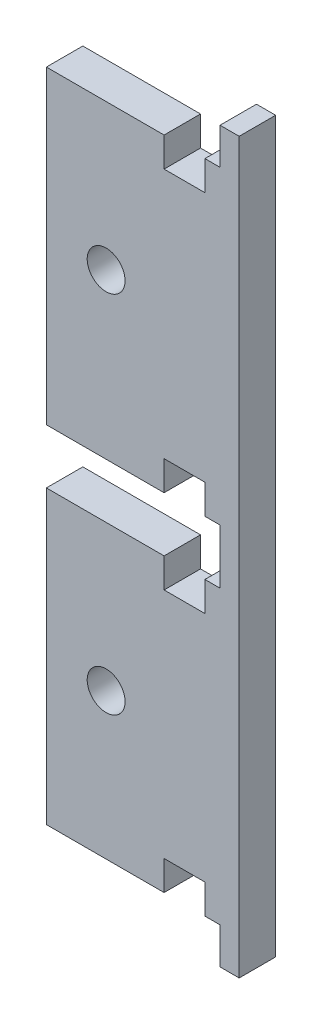
ISO-10303-21;
HEADER;
FILE_DESCRIPTION(('STEP AP214'),'2;1');
FILE_NAME('part.step','',(''),(''),'','','');
FILE_SCHEMA(('AUTOMOTIVE_DESIGN { 1 0 10303 214 1 1 1 1 }'));
ENDSEC;
DATA;
#1=APPLICATION_CONTEXT('core data for automotive mechanical design processes');
#2=APPLICATION_PROTOCOL_DEFINITION('international standard','automotive_design',2000,#1);
#3=PRODUCT_CONTEXT('',#1,'mechanical');
#4=PRODUCT('Part','Part','',(#3));
#5=PRODUCT_RELATED_PRODUCT_CATEGORY('part','',(#4));
#6=PRODUCT_DEFINITION_FORMATION('','',#4);
#7=PRODUCT_DEFINITION_CONTEXT('part definition',#1,'design');
#8=PRODUCT_DEFINITION('design','',#6,#7);
#9=PRODUCT_DEFINITION_SHAPE('','',#8);
#10=(LENGTH_UNIT() NAMED_UNIT(*) SI_UNIT(.MILLI.,.METRE.));
#11=(NAMED_UNIT(*) PLANE_ANGLE_UNIT() SI_UNIT($,.RADIAN.));
#12=(NAMED_UNIT(*) SI_UNIT($,.STERADIAN.) SOLID_ANGLE_UNIT());
#13=UNCERTAINTY_MEASURE_WITH_UNIT(LENGTH_MEASURE(1.E-05),#10,'distance_accuracy_value','');
#14=(GEOMETRIC_REPRESENTATION_CONTEXT(3) GLOBAL_UNCERTAINTY_ASSIGNED_CONTEXT((#13)) GLOBAL_UNIT_ASSIGNED_CONTEXT((#10,
#11,#12)) REPRESENTATION_CONTEXT('',''));
#15=CARTESIAN_POINT('',(0.,0.,0.));
#16=DIRECTION('',(0.,0.,1.));
#17=DIRECTION('',(1.,0.,0.));
#18=AXIS2_PLACEMENT_3D('',#15,#16,#17);
#19=CARTESIAN_POINT('',(0.,0.,0.));
#20=DIRECTION('',(0.,0.,-1.));
#21=DIRECTION('',(-1.,0.,0.));
#22=AXIS2_PLACEMENT_3D('',#19,#20,#21);
#23=PLANE('',#22);
#24=DIRECTION('',(0.,-1.,0.));
#25=VECTOR('',#24,1.);
#26=CARTESIAN_POINT('',(27.559,0.,0.));
#27=LINE('',#26,#25);
#28=CARTESIAN_POINT('',(27.559,11.4935,0.));
#29=VERTEX_POINT('',#28);
#30=CARTESIAN_POINT('',(27.559,6.34999999999999,0.));
#31=VERTEX_POINT('',#30);
#32=EDGE_CURVE('E225',#29,#31,#27,.T.);
#33=ORIENTED_EDGE('',*,*,#32,.T.);
#34=DIRECTION('',(-1.,0.,0.));
#35=VECTOR('',#34,1.);
#36=CARTESIAN_POINT('',(0.,6.34999999999999,0.));
#37=LINE('',#36,#35);
#38=CARTESIAN_POINT('',(7.05049999999835,6.34999999999999,0.));
#39=VERTEX_POINT('',#38);
#40=EDGE_CURVE('E365',#31,#39,#37,.T.);
#41=ORIENTED_EDGE('',*,*,#40,.T.);
#42=DIRECTION('',(0.,-1.,0.));
#43=VECTOR('',#42,1.);
#44=CARTESIAN_POINT('',(7.05049999999835,0.,0.));
#45=LINE('',#44,#43);
#46=CARTESIAN_POINT('',(7.05049999999834,57.1500000000057,0.));
#47=VERTEX_POINT('',#46);
#48=EDGE_CURVE('E326',#47,#39,#45,.T.);
#49=ORIENTED_EDGE('',*,*,#48,.F.);
#50=DIRECTION('',(1.,0.,0.));
#51=VECTOR('',#50,1.);
#52=CARTESIAN_POINT('',(0.,57.1500000000057,0.));
#53=LINE('',#52,#51);
#54=CARTESIAN_POINT('',(27.5589999999997,57.1500000000057,0.));
#55=VERTEX_POINT('',#54);
#56=EDGE_CURVE('E331',#47,#55,#53,.T.);
#57=ORIENTED_EDGE('',*,*,#56,.T.);
#58=DIRECTION('',(0.,-1.,0.));
#59=VECTOR('',#58,1.);
#60=CARTESIAN_POINT('',(27.5589999999997,0.,0.));
#61=LINE('',#60,#59);
#62=CARTESIAN_POINT('',(27.5589999999997,52.0065000000031,0.));
#63=VERTEX_POINT('',#62);
#64=EDGE_CURVE('E250',#55,#63,#61,.T.);
#65=ORIENTED_EDGE('',*,*,#64,.T.);
#66=DIRECTION('',(-1.,0.,0.));
#67=VECTOR('',#66,1.);
#68=CARTESIAN_POINT('',(0.,52.0065000000031,0.));
#69=LINE('',#68,#67);
#70=CARTESIAN_POINT('',(34.6709999999997,52.0065000000031,0.));
#71=VERTEX_POINT('',#70);
#72=EDGE_CURVE('E253',#71,#63,#69,.T.);
#73=ORIENTED_EDGE('',*,*,#72,.F.);
#74=DIRECTION('',(0.,-1.,0.));
#75=VECTOR('',#74,1.);
#76=CARTESIAN_POINT('',(34.6709999999997,0.,0.));
#77=LINE('',#76,#75);
#78=CARTESIAN_POINT('',(34.6709999999997,57.1500000000057,0.));
#79=VERTEX_POINT('',#78);
#80=EDGE_CURVE('E256',#79,#71,#77,.T.);
#81=ORIENTED_EDGE('',*,*,#80,.F.);
#82=CARTESIAN_POINT('',(37.3062500000001,57.1500000000057,0.));
#83=VERTEX_POINT('',#82);
#84=EDGE_CURVE('E335',#79,#83,#53,.T.);
#85=ORIENTED_EDGE('',*,*,#84,.T.);
#86=DIRECTION('',(0.,-1.,0.));
#87=VECTOR('',#86,1.);
#88=CARTESIAN_POINT('',(37.3062500000001,0.,0.));
#89=LINE('',#88,#87);
#90=CARTESIAN_POINT('',(37.3062500000001,66.6750000000059,0.));
#91=VERTEX_POINT('',#90);
#92=EDGE_CURVE('E334',#91,#83,#89,.T.);
#93=ORIENTED_EDGE('',*,*,#92,.F.);
#94=DIRECTION('',(-1.,0.,0.));
#95=VECTOR('',#94,1.);
#96=CARTESIAN_POINT('',(0.,66.6750000000059,0.));
#97=LINE('',#96,#95);
#98=CARTESIAN_POINT('',(34.6709999999998,66.6750000000059,0.));
#99=VERTEX_POINT('',#98);
#100=EDGE_CURVE('E339',#91,#99,#97,.T.);
#101=ORIENTED_EDGE('',*,*,#100,.T.);
#102=DIRECTION('',(0.,-1.,0.));
#103=VECTOR('',#102,1.);
#104=CARTESIAN_POINT('',(34.6709999999998,0.,0.));
#105=LINE('',#104,#103);
#106=CARTESIAN_POINT('',(34.6709999999998,71.8185000000033,0.));
#107=VERTEX_POINT('',#106);
#108=EDGE_CURVE('E270',#107,#99,#105,.T.);
#109=ORIENTED_EDGE('',*,*,#108,.F.);
#110=DIRECTION('',(-1.,0.,0.));
#111=VECTOR('',#110,1.);
#112=CARTESIAN_POINT('',(0.,71.8185000000033,0.));
#113=LINE('',#112,#111);
#114=CARTESIAN_POINT('',(27.5589999999998,71.8185000000033,0.));
#115=VERTEX_POINT('',#114);
#116=EDGE_CURVE('E272',#107,#115,#113,.T.);
#117=ORIENTED_EDGE('',*,*,#116,.T.);
#118=DIRECTION('',(0.,-1.,0.));
#119=VECTOR('',#118,1.);
#120=CARTESIAN_POINT('',(27.5589999999998,0.,0.));
#121=LINE('',#120,#119);
#122=CARTESIAN_POINT('',(27.5589999999998,66.6750000000059,0.));
#123=VERTEX_POINT('',#122);
#124=EDGE_CURVE('E275',#115,#123,#121,.T.);
#125=ORIENTED_EDGE('',*,*,#124,.T.);
#126=CARTESIAN_POINT('',(7.05049999999834,66.6750000000059,0.));
#127=VERTEX_POINT('',#126);
#128=EDGE_CURVE('E338',#123,#127,#97,.T.);
#129=ORIENTED_EDGE('',*,*,#128,.T.);
#130=CARTESIAN_POINT('',(7.05049999999834,120.650000000002,0.));
#131=VERTEX_POINT('',#130);
#132=EDGE_CURVE('E382',#131,#127,#45,.T.);
#133=ORIENTED_EDGE('',*,*,#132,.F.);
#134=DIRECTION('',(1.,0.,0.));
#135=VECTOR('',#134,1.);
#136=CARTESIAN_POINT('',(0.,120.650000000002,0.));
#137=LINE('',#136,#135);
#138=CARTESIAN_POINT('',(27.5589999999998,120.650000000002,0.));
#139=VERTEX_POINT('',#138);
#140=EDGE_CURVE('E308',#131,#139,#137,.T.);
#141=ORIENTED_EDGE('',*,*,#140,.T.);
#142=DIRECTION('',(0.,-1.,0.));
#143=VECTOR('',#142,1.);
#144=CARTESIAN_POINT('',(27.5589999999998,0.,0.));
#145=LINE('',#144,#143);
#146=CARTESIAN_POINT('',(27.5589999999998,115.5065,0.));
#147=VERTEX_POINT('',#146);
#148=EDGE_CURVE('E289',#139,#147,#145,.T.);
#149=ORIENTED_EDGE('',*,*,#148,.T.);
#150=DIRECTION('',(-1.,0.,0.));
#151=VECTOR('',#150,1.);
#152=CARTESIAN_POINT('',(0.,115.5065,0.));
#153=LINE('',#152,#151);
#154=CARTESIAN_POINT('',(34.6709999999998,115.5065,0.));
#155=VERTEX_POINT('',#154);
#156=EDGE_CURVE('E292',#155,#147,#153,.T.);
#157=ORIENTED_EDGE('',*,*,#156,.F.);
#158=DIRECTION('',(0.,-1.,0.));
#159=VECTOR('',#158,1.);
#160=CARTESIAN_POINT('',(34.6709999999998,0.,0.));
#161=LINE('',#160,#159);
#162=CARTESIAN_POINT('',(34.6709999999998,120.650000000002,0.));
#163=VERTEX_POINT('',#162);
#164=EDGE_CURVE('E295',#163,#155,#161,.T.);
#165=ORIENTED_EDGE('',*,*,#164,.F.);
#166=CARTESIAN_POINT('',(37.3062500000001,120.650000000002,0.));
#167=VERTEX_POINT('',#166);
#168=EDGE_CURVE('E312',#163,#167,#137,.T.);
#169=ORIENTED_EDGE('',*,*,#168,.T.);
#170=DIRECTION('',(0.,-1.,0.));
#171=VECTOR('',#170,1.);
#172=CARTESIAN_POINT('',(37.3062500000001,0.,0.));
#173=LINE('',#172,#171);
#174=CARTESIAN_POINT('',(37.30625,127.,0.));
#175=VERTEX_POINT('',#174);
#176=EDGE_CURVE('E311',#175,#167,#173,.T.);
#177=ORIENTED_EDGE('',*,*,#176,.F.);
#178=DIRECTION('',(-1.,0.,0.));
#179=VECTOR('',#178,1.);
#180=CARTESIAN_POINT('',(0.,127.,0.));
#181=LINE('',#180,#179);
#182=CARTESIAN_POINT('',(40.64,127.,0.));
#183=VERTEX_POINT('',#182);
#184=EDGE_CURVE('E403',#183,#175,#181,.T.);
#185=ORIENTED_EDGE('',*,*,#184,.F.);
#186=DIRECTION('',(0.,1.,0.));
#187=VECTOR('',#186,1.);
#188=CARTESIAN_POINT('',(40.64,0.,0.));
#189=LINE('',#188,#187);
#190=CARTESIAN_POINT('',(40.64,0.,0.));
#191=VERTEX_POINT('',#190);
#192=EDGE_CURVE('E410',#191,#183,#189,.T.);
#193=ORIENTED_EDGE('',*,*,#192,.F.);
#194=DIRECTION('',(1.,0.,0.));
#195=VECTOR('',#194,1.);
#196=CARTESIAN_POINT('',(0.,0.,0.));
#197=LINE('',#196,#195);
#198=CARTESIAN_POINT('',(37.3062500000001,0.,0.));
#199=VERTEX_POINT('',#198);
#200=EDGE_CURVE('E399',#199,#191,#197,.T.);
#201=ORIENTED_EDGE('',*,*,#200,.F.);
#202=DIRECTION('',(0.,-1.,0.));
#203=VECTOR('',#202,1.);
#204=CARTESIAN_POINT('',(37.3062500000001,0.,0.));
#205=LINE('',#204,#203);
#206=CARTESIAN_POINT('',(37.3062500000001,6.34999999999999,0.));
#207=VERTEX_POINT('',#206);
#208=EDGE_CURVE('E363',#207,#199,#205,.T.);
#209=ORIENTED_EDGE('',*,*,#208,.F.);
#210=CARTESIAN_POINT('',(34.671,6.34999999999999,0.));
#211=VERTEX_POINT('',#210);
#212=EDGE_CURVE('E238',#207,#211,#37,.T.);
#213=ORIENTED_EDGE('',*,*,#212,.T.);
#214=DIRECTION('',(0.,-1.,0.));
#215=VECTOR('',#214,1.);
#216=CARTESIAN_POINT('',(34.671,0.,0.));
#217=LINE('',#216,#215);
#218=CARTESIAN_POINT('',(34.671,11.4935,0.));
#219=VERTEX_POINT('',#218);
#220=EDGE_CURVE('E48',#219,#211,#217,.T.);
#221=ORIENTED_EDGE('',*,*,#220,.F.);
#222=DIRECTION('',(-1.,0.,0.));
#223=VECTOR('',#222,1.);
#224=CARTESIAN_POINT('',(0.,11.4935,0.));
#225=LINE('',#224,#223);
#226=EDGE_CURVE('E228',#219,#29,#225,.T.);
#227=ORIENTED_EDGE('',*,*,#226,.T.);
#228=EDGE_LOOP('',(#33,#41,#49,#57,#65,#73,#81,#85,#93,#101,#109,#117,#125,#129,#133,#141,#149,
#157,#165,#169,#177,#185,#193,#201,#209,#213,#221,#227));
#229=FACE_BOUND('',#228,.T.);
#230=CARTESIAN_POINT('',(17.4625000000007,31.7500000000036,0.));
#231=DIRECTION('',(0.,0.,1.));
#232=DIRECTION('',(1.,0.,0.));
#233=AXIS2_PLACEMENT_3D('',#230,#231,#232);
#234=CIRCLE('',#233,3.3);
#235=CARTESIAN_POINT('',(20.7625000000007,31.7500000000036,0.));
#236=VERTEX_POINT('',#235);
#237=EDGE_CURVE('E390',#236,#236,#234,.T.);
#238=ORIENTED_EDGE('',*,*,#237,.T.);
#239=EDGE_LOOP('',(#238));
#240=FACE_BOUND('',#239,.T.);
#241=CARTESIAN_POINT('',(17.4624999999983,95.25,0.));
#242=DIRECTION('',(0.,0.,1.));
#243=DIRECTION('',(1.,0.,0.));
#244=AXIS2_PLACEMENT_3D('',#241,#242,#243);
#245=CIRCLE('',#244,3.3);
#246=CARTESIAN_POINT('',(20.7624999999983,95.25,0.));
#247=VERTEX_POINT('',#246);
#248=EDGE_CURVE('E396',#247,#247,#245,.T.);
#249=ORIENTED_EDGE('',*,*,#248,.T.);
#250=EDGE_LOOP('',(#249));
#251=FACE_BOUND('',#250,.T.);
#252=ADVANCED_FACE('F33',(#229,#240,#251),#23,.T.);
#253=CARTESIAN_POINT('',(0.,0.,6.35));
#254=DIRECTION('',(0.,0.,-1.));
#255=DIRECTION('',(-1.,0.,0.));
#256=AXIS2_PLACEMENT_3D('',#253,#254,#255);
#257=PLANE('',#256);
#258=CARTESIAN_POINT('',(17.4624999999983,95.25,6.35));
#259=DIRECTION('',(0.,0.,1.));
#260=DIRECTION('',(1.,0.,0.));
#261=AXIS2_PLACEMENT_3D('',#258,#259,#260);
#262=CIRCLE('',#261,3.29999999999999);
#263=CARTESIAN_POINT('',(20.7624999999983,95.25,6.35));
#264=VERTEX_POINT('',#263);
#265=EDGE_CURVE('E393',#264,#264,#262,.T.);
#266=ORIENTED_EDGE('',*,*,#265,.F.);
#267=EDGE_LOOP('',(#266));
#268=FACE_BOUND('',#267,.T.);
#269=CARTESIAN_POINT('',(17.4625000000007,31.7500000000036,6.35));
#270=DIRECTION('',(0.,0.,1.));
#271=DIRECTION('',(1.,0.,0.));
#272=AXIS2_PLACEMENT_3D('',#269,#270,#271);
#273=CIRCLE('',#272,3.29999999999999);
#274=CARTESIAN_POINT('',(20.7625000000006,31.7500000000036,6.35));
#275=VERTEX_POINT('',#274);
#276=EDGE_CURVE('E387',#275,#275,#273,.T.);
#277=ORIENTED_EDGE('',*,*,#276,.F.);
#278=EDGE_LOOP('',(#277));
#279=FACE_BOUND('',#278,.T.);
#280=DIRECTION('',(-1.,0.,0.));
#281=VECTOR('',#280,1.);
#282=CARTESIAN_POINT('',(0.,6.34999999999999,6.35));
#283=LINE('',#282,#281);
#284=CARTESIAN_POINT('',(27.559,6.34999999999999,6.35));
#285=VERTEX_POINT('',#284);
#286=CARTESIAN_POINT('',(7.05049999999835,6.34999999999999,6.35));
#287=VERTEX_POINT('',#286);
#288=EDGE_CURVE('E371',#285,#287,#283,.T.);
#289=ORIENTED_EDGE('',*,*,#288,.F.);
#290=DIRECTION('',(0.,-1.,0.));
#291=VECTOR('',#290,1.);
#292=CARTESIAN_POINT('',(27.559,0.,6.35));
#293=LINE('',#292,#291);
#294=CARTESIAN_POINT('',(27.559,11.4935,6.35));
#295=VERTEX_POINT('',#294);
#296=EDGE_CURVE('E239',#295,#285,#293,.T.);
#297=ORIENTED_EDGE('',*,*,#296,.F.);
#298=DIRECTION('',(-1.,0.,0.));
#299=VECTOR('',#298,1.);
#300=CARTESIAN_POINT('',(0.,11.4935,6.35));
#301=LINE('',#300,#299);
#302=CARTESIAN_POINT('',(34.671,11.4935,6.35));
#303=VERTEX_POINT('',#302);
#304=EDGE_CURVE('E241',#303,#295,#301,.T.);
#305=ORIENTED_EDGE('',*,*,#304,.F.);
#306=DIRECTION('',(0.,-1.,0.));
#307=VECTOR('',#306,1.);
#308=CARTESIAN_POINT('',(34.671,0.,6.35));
#309=LINE('',#308,#307);
#310=CARTESIAN_POINT('',(34.671,6.34999999999999,6.35));
#311=VERTEX_POINT('',#310);
#312=EDGE_CURVE('E220',#303,#311,#309,.T.);
#313=ORIENTED_EDGE('',*,*,#312,.T.);
#314=CARTESIAN_POINT('',(37.3062500000001,6.34999999999999,6.35));
#315=VERTEX_POINT('',#314);
#316=EDGE_CURVE('E366',#315,#311,#283,.T.);
#317=ORIENTED_EDGE('',*,*,#316,.F.);
#318=DIRECTION('',(0.,-1.,0.));
#319=VECTOR('',#318,1.);
#320=CARTESIAN_POINT('',(37.3062500000001,0.,6.35));
#321=LINE('',#320,#319);
#322=CARTESIAN_POINT('',(37.3062500000001,0.,6.35));
#323=VERTEX_POINT('',#322);
#324=EDGE_CURVE('E248',#315,#323,#321,.T.);
#325=ORIENTED_EDGE('',*,*,#324,.T.);
#326=DIRECTION('',(1.,0.,0.));
#327=VECTOR('',#326,1.);
#328=CARTESIAN_POINT('',(0.,0.,6.35));
#329=LINE('',#328,#327);
#330=CARTESIAN_POINT('',(40.64,0.,6.35));
#331=VERTEX_POINT('',#330);
#332=EDGE_CURVE('E400',#323,#331,#329,.T.);
#333=ORIENTED_EDGE('',*,*,#332,.T.);
#334=DIRECTION('',(0.,1.,0.));
#335=VECTOR('',#334,1.);
#336=CARTESIAN_POINT('',(40.64,0.,6.35));
#337=LINE('',#336,#335);
#338=CARTESIAN_POINT('',(40.64,127.,6.35));
#339=VERTEX_POINT('',#338);
#340=EDGE_CURVE('E402',#331,#339,#337,.T.);
#341=ORIENTED_EDGE('',*,*,#340,.T.);
#342=DIRECTION('',(-1.,0.,0.));
#343=VECTOR('',#342,1.);
#344=CARTESIAN_POINT('',(0.,127.,6.35));
#345=LINE('',#344,#343);
#346=CARTESIAN_POINT('',(37.30625,127.,6.35));
#347=VERTEX_POINT('',#346);
#348=EDGE_CURVE('E405',#339,#347,#345,.T.);
#349=ORIENTED_EDGE('',*,*,#348,.T.);
#350=DIRECTION('',(0.,-1.,0.));
#351=VECTOR('',#350,1.);
#352=CARTESIAN_POINT('',(37.3062500000001,0.,6.35));
#353=LINE('',#352,#351);
#354=CARTESIAN_POINT('',(37.3062500000001,120.650000000002,6.35));
#355=VERTEX_POINT('',#354);
#356=EDGE_CURVE('E319',#347,#355,#353,.T.);
#357=ORIENTED_EDGE('',*,*,#356,.T.);
#358=DIRECTION('',(1.,0.,0.));
#359=VECTOR('',#358,1.);
#360=CARTESIAN_POINT('',(0.,120.650000000002,6.35));
#361=LINE('',#360,#359);
#362=CARTESIAN_POINT('',(34.6709999999998,120.650000000002,6.35));
#363=VERTEX_POINT('',#362);
#364=EDGE_CURVE('E320',#363,#355,#361,.T.);
#365=ORIENTED_EDGE('',*,*,#364,.F.);
#366=DIRECTION('',(0.,-1.,0.));
#367=VECTOR('',#366,1.);
#368=CARTESIAN_POINT('',(34.6709999999998,0.,6.35));
#369=LINE('',#368,#367);
#370=CARTESIAN_POINT('',(34.6709999999998,115.5065,6.35));
#371=VERTEX_POINT('',#370);
#372=EDGE_CURVE('E293',#363,#371,#369,.T.);
#373=ORIENTED_EDGE('',*,*,#372,.T.);
#374=DIRECTION('',(-1.,0.,0.));
#375=VECTOR('',#374,1.);
#376=CARTESIAN_POINT('',(0.,115.5065,6.35));
#377=LINE('',#376,#375);
#378=CARTESIAN_POINT('',(27.5589999999998,115.5065,6.35));
#379=VERTEX_POINT('',#378);
#380=EDGE_CURVE('E300',#371,#379,#377,.T.);
#381=ORIENTED_EDGE('',*,*,#380,.T.);
#382=DIRECTION('',(0.,-1.,0.));
#383=VECTOR('',#382,1.);
#384=CARTESIAN_POINT('',(27.5589999999998,0.,6.35));
#385=LINE('',#384,#383);
#386=CARTESIAN_POINT('',(27.5589999999998,120.650000000002,6.35));
#387=VERTEX_POINT('',#386);
#388=EDGE_CURVE('E298',#387,#379,#385,.T.);
#389=ORIENTED_EDGE('',*,*,#388,.F.);
#390=CARTESIAN_POINT('',(7.05049999999834,120.650000000002,6.35));
#391=VERTEX_POINT('',#390);
#392=EDGE_CURVE('E316',#391,#387,#361,.T.);
#393=ORIENTED_EDGE('',*,*,#392,.F.);
#394=DIRECTION('',(0.,1.,0.));
#395=VECTOR('',#394,1.);
#396=CARTESIAN_POINT('',(7.05049999999835,0.,6.35));
#397=LINE('',#396,#395);
#398=CARTESIAN_POINT('',(7.05049999999834,66.6750000000059,6.35));
#399=VERTEX_POINT('',#398);
#400=EDGE_CURVE('E383',#399,#391,#397,.T.);
#401=ORIENTED_EDGE('',*,*,#400,.F.);
#402=DIRECTION('',(-1.,0.,0.));
#403=VECTOR('',#402,1.);
#404=CARTESIAN_POINT('',(0.,66.6750000000059,6.35));
#405=LINE('',#404,#403);
#406=CARTESIAN_POINT('',(27.5589999999998,66.6750000000059,6.35));
#407=VERTEX_POINT('',#406);
#408=EDGE_CURVE('E350',#407,#399,#405,.T.);
#409=ORIENTED_EDGE('',*,*,#408,.F.);
#410=DIRECTION('',(0.,-1.,0.));
#411=VECTOR('',#410,1.);
#412=CARTESIAN_POINT('',(27.5589999999998,0.,6.35));
#413=LINE('',#412,#411);
#414=CARTESIAN_POINT('',(27.5589999999998,71.8185000000033,6.35));
#415=VERTEX_POINT('',#414);
#416=EDGE_CURVE('E56',#415,#407,#413,.T.);
#417=ORIENTED_EDGE('',*,*,#416,.F.);
#418=DIRECTION('',(-1.,0.,0.));
#419=VECTOR('',#418,1.);
#420=CARTESIAN_POINT('',(0.,71.8185000000033,6.35));
#421=LINE('',#420,#419);
#422=CARTESIAN_POINT('',(34.6709999999998,71.8185000000033,6.35));
#423=VERTEX_POINT('',#422);
#424=EDGE_CURVE('E282',#423,#415,#421,.T.);
#425=ORIENTED_EDGE('',*,*,#424,.F.);
#426=DIRECTION('',(0.,-1.,0.));
#427=VECTOR('',#426,1.);
#428=CARTESIAN_POINT('',(34.6709999999998,0.,6.35));
#429=LINE('',#428,#427);
#430=CARTESIAN_POINT('',(34.6709999999998,66.6750000000059,6.35));
#431=VERTEX_POINT('',#430);
#432=EDGE_CURVE('E279',#423,#431,#429,.T.);
#433=ORIENTED_EDGE('',*,*,#432,.T.);
#434=CARTESIAN_POINT('',(37.3062500000001,66.6750000000059,6.35));
#435=VERTEX_POINT('',#434);
#436=EDGE_CURVE('E351',#435,#431,#405,.T.);
#437=ORIENTED_EDGE('',*,*,#436,.F.);
#438=DIRECTION('',(0.,-1.,0.));
#439=VECTOR('',#438,1.);
#440=CARTESIAN_POINT('',(37.3062500000001,0.,6.35));
#441=LINE('',#440,#439);
#442=CARTESIAN_POINT('',(37.3062500000001,57.1500000000057,6.35));
#443=VERTEX_POINT('',#442);
#444=EDGE_CURVE('E346',#435,#443,#441,.T.);
#445=ORIENTED_EDGE('',*,*,#444,.T.);
#446=DIRECTION('',(1.,0.,0.));
#447=VECTOR('',#446,1.);
#448=CARTESIAN_POINT('',(0.,57.1500000000057,6.35));
#449=LINE('',#448,#447);
#450=CARTESIAN_POINT('',(34.6709999999997,57.1500000000057,6.35));
#451=VERTEX_POINT('',#450);
#452=EDGE_CURVE('E347',#451,#443,#449,.T.);
#453=ORIENTED_EDGE('',*,*,#452,.F.);
#454=DIRECTION('',(0.,-1.,0.));
#455=VECTOR('',#454,1.);
#456=CARTESIAN_POINT('',(34.6709999999997,0.,6.35));
#457=LINE('',#456,#455);
#458=CARTESIAN_POINT('',(34.6709999999997,52.0065000000031,6.35));
#459=VERTEX_POINT('',#458);
#460=EDGE_CURVE('E254',#451,#459,#457,.T.);
#461=ORIENTED_EDGE('',*,*,#460,.T.);
#462=DIRECTION('',(-1.,0.,0.));
#463=VECTOR('',#462,1.);
#464=CARTESIAN_POINT('',(0.,52.0065000000031,6.35));
#465=LINE('',#464,#463);
#466=CARTESIAN_POINT('',(27.5589999999997,52.0065000000031,6.35));
#467=VERTEX_POINT('',#466);
#468=EDGE_CURVE('E261',#459,#467,#465,.T.);
#469=ORIENTED_EDGE('',*,*,#468,.T.);
#470=DIRECTION('',(0.,-1.,0.));
#471=VECTOR('',#470,1.);
#472=CARTESIAN_POINT('',(27.5589999999997,0.,6.35));
#473=LINE('',#472,#471);
#474=CARTESIAN_POINT('',(27.5589999999997,57.1500000000057,6.35));
#475=VERTEX_POINT('',#474);
#476=EDGE_CURVE('E259',#475,#467,#473,.T.);
#477=ORIENTED_EDGE('',*,*,#476,.F.);
#478=CARTESIAN_POINT('',(7.05049999999834,57.1500000000057,6.35));
#479=VERTEX_POINT('',#478);
#480=EDGE_CURVE('E343',#479,#475,#449,.T.);
#481=ORIENTED_EDGE('',*,*,#480,.F.);
#482=EDGE_CURVE('E386',#287,#479,#397,.T.);
#483=ORIENTED_EDGE('',*,*,#482,.F.);
#484=EDGE_LOOP('',(#289,#297,#305,#313,#317,#325,#333,#341,#349,#357,#365,#373,#381,#389,#393,
#401,#409,#417,#425,#433,#437,#445,#453,#461,#469,#477,#481,#483));
#485=FACE_BOUND('',#484,.T.);
#486=ADVANCED_FACE('F436',(#268,#279,#485),#257,.F.);
#487=CARTESIAN_POINT('',(0.,6.34999999999999,0.));
#488=DIRECTION('',(0.,1.,0.));
#489=DIRECTION('',(-1.,0.,0.));
#490=AXIS2_PLACEMENT_3D('',#487,#488,#489);
#491=PLANE('',#490);
#492=DIRECTION('',(0.,0.,1.));
#493=VECTOR('',#492,1.);
#494=CARTESIAN_POINT('',(34.671,6.34999999999999,0.));
#495=LINE('',#494,#493);
#496=EDGE_CURVE('E41',#211,#311,#495,.T.);
#497=ORIENTED_EDGE('',*,*,#496,.F.);
#498=ORIENTED_EDGE('',*,*,#212,.F.);
#499=DIRECTION('',(0.,0.,1.));
#500=VECTOR('',#499,1.);
#501=CARTESIAN_POINT('',(37.3062500000001,6.34999999999999,0.));
#502=LINE('',#501,#500);
#503=EDGE_CURVE('E377',#207,#315,#502,.T.);
#504=ORIENTED_EDGE('',*,*,#503,.T.);
#505=ORIENTED_EDGE('',*,*,#316,.T.);
#506=EDGE_LOOP('',(#497,#498,#504,#505));
#507=FACE_BOUND('',#506,.T.);
#508=ADVANCED_FACE('F438',(#507),#491,.F.);
#509=CARTESIAN_POINT('',(0.,66.6750000000059,0.));
#510=DIRECTION('',(0.,1.,0.));
#511=DIRECTION('',(-1.,0.,0.));
#512=AXIS2_PLACEMENT_3D('',#509,#510,#511);
#513=PLANE('',#512);
#514=DIRECTION('',(0.,0.,1.));
#515=VECTOR('',#514,1.);
#516=CARTESIAN_POINT('',(34.6709999999998,66.6750000000059,0.));
#517=LINE('',#516,#515);
#518=EDGE_CURVE('E431',#99,#431,#517,.T.);
#519=ORIENTED_EDGE('',*,*,#518,.F.);
#520=ORIENTED_EDGE('',*,*,#100,.F.);
#521=DIRECTION('',(0.,0.,1.));
#522=VECTOR('',#521,1.);
#523=CARTESIAN_POINT('',(37.3062500000001,66.6750000000059,0.));
#524=LINE('',#523,#522);
#525=EDGE_CURVE('E357',#91,#435,#524,.T.);
#526=ORIENTED_EDGE('',*,*,#525,.T.);
#527=ORIENTED_EDGE('',*,*,#436,.T.);
#528=EDGE_LOOP('',(#519,#520,#526,#527));
#529=FACE_BOUND('',#528,.T.);
#530=ADVANCED_FACE('F503',(#529),#513,.F.);
#531=CARTESIAN_POINT('',(0.,57.1500000000057,0.));
#532=DIRECTION('',(0.,-1.,0.));
#533=DIRECTION('',(0.,0.,-1.));
#534=AXIS2_PLACEMENT_3D('',#531,#532,#533);
#535=PLANE('',#534);
#536=DIRECTION('',(0.,0.,-1.));
#537=VECTOR('',#536,1.);
#538=CARTESIAN_POINT('',(34.6709999999997,57.1500000000057,0.));
#539=LINE('',#538,#537);
#540=EDGE_CURVE('E427',#451,#79,#539,.T.);
#541=ORIENTED_EDGE('',*,*,#540,.F.);
#542=ORIENTED_EDGE('',*,*,#452,.T.);
#543=DIRECTION('',(0.,0.,1.));
#544=VECTOR('',#543,1.);
#545=CARTESIAN_POINT('',(37.3062500000001,57.1500000000057,0.));
#546=LINE('',#545,#544);
#547=EDGE_CURVE('E359',#83,#443,#546,.T.);
#548=ORIENTED_EDGE('',*,*,#547,.F.);
#549=ORIENTED_EDGE('',*,*,#84,.F.);
#550=EDGE_LOOP('',(#541,#542,#548,#549));
#551=FACE_BOUND('',#550,.T.);
#552=ADVANCED_FACE('F513',(#551),#535,.F.);
#553=CARTESIAN_POINT('',(0.,120.650000000002,0.));
#554=DIRECTION('',(0.,-1.,0.));
#555=DIRECTION('',(0.,0.,-1.));
#556=AXIS2_PLACEMENT_3D('',#553,#554,#555);
#557=PLANE('',#556);
#558=DIRECTION('',(0.,0.,-1.));
#559=VECTOR('',#558,1.);
#560=CARTESIAN_POINT('',(34.6709999999998,120.650000000002,0.));
#561=LINE('',#560,#559);
#562=EDGE_CURVE('E422',#363,#163,#561,.T.);
#563=ORIENTED_EDGE('',*,*,#562,.F.);
#564=ORIENTED_EDGE('',*,*,#364,.T.);
#565=DIRECTION('',(0.,0.,1.));
#566=VECTOR('',#565,1.);
#567=CARTESIAN_POINT('',(37.3062500000001,120.650000000002,0.));
#568=LINE('',#567,#566);
#569=EDGE_CURVE('E327',#167,#355,#568,.T.);
#570=ORIENTED_EDGE('',*,*,#569,.F.);
#571=ORIENTED_EDGE('',*,*,#168,.F.);
#572=EDGE_LOOP('',(#563,#564,#570,#571));
#573=FACE_BOUND('',#572,.T.);
#574=ADVANCED_FACE('F466',(#573),#557,.F.);
#575=CARTESIAN_POINT('',(0.,0.,6.35));
#576=DIRECTION('',(0.,1.,0.));
#577=DIRECTION('',(0.,0.,1.));
#578=AXIS2_PLACEMENT_3D('',#575,#576,#577);
#579=PLANE('',#578);
#580=DIRECTION('',(0.,0.,1.));
#581=VECTOR('',#580,1.);
#582=CARTESIAN_POINT('',(37.3062500000001,0.,0.));
#583=LINE('',#582,#581);
#584=EDGE_CURVE('E368',#199,#323,#583,.T.);
#585=ORIENTED_EDGE('',*,*,#584,.F.);
#586=ORIENTED_EDGE('',*,*,#200,.T.);
#587=DIRECTION('',(0.,0.,-1.));
#588=VECTOR('',#587,1.);
#589=CARTESIAN_POINT('',(40.64,0.,6.35));
#590=LINE('',#589,#588);
#591=EDGE_CURVE('E416',#331,#191,#590,.T.);
#592=ORIENTED_EDGE('',*,*,#591,.F.);
#593=ORIENTED_EDGE('',*,*,#332,.F.);
#594=EDGE_LOOP('',(#585,#586,#592,#593));
#595=FACE_BOUND('',#594,.T.);
#596=ADVANCED_FACE('F35',(#595),#579,.F.);
#597=CARTESIAN_POINT('',(0.,127.,6.35));
#598=DIRECTION('',(0.,-1.,0.));
#599=DIRECTION('',(1.,0.,0.));
#600=AXIS2_PLACEMENT_3D('',#597,#598,#599);
#601=PLANE('',#600);
#602=DIRECTION('',(0.,0.,1.));
#603=VECTOR('',#602,1.);
#604=CARTESIAN_POINT('',(37.30625,127.,0.));
#605=LINE('',#604,#603);
#606=EDGE_CURVE('E323',#175,#347,#605,.T.);
#607=ORIENTED_EDGE('',*,*,#606,.T.);
#608=ORIENTED_EDGE('',*,*,#348,.F.);
#609=DIRECTION('',(0.,0.,-1.));
#610=VECTOR('',#609,1.);
#611=CARTESIAN_POINT('',(40.64,127.,6.35));
#612=LINE('',#611,#610);
#613=EDGE_CURVE('E408',#339,#183,#612,.T.);
#614=ORIENTED_EDGE('',*,*,#613,.T.);
#615=ORIENTED_EDGE('',*,*,#184,.T.);
#616=EDGE_LOOP('',(#607,#608,#614,#615));
#617=FACE_BOUND('',#616,.T.);
#618=ADVANCED_FACE('F455',(#617),#601,.F.);
#619=CARTESIAN_POINT('',(7.05049999999835,0.,0.));
#620=DIRECTION('',(-1.,0.,0.));
#621=DIRECTION('',(0.,-1.,0.));
#622=AXIS2_PLACEMENT_3D('',#619,#620,#621);
#623=PLANE('',#622);
#624=DIRECTION('',(0.,0.,1.));
#625=VECTOR('',#624,1.);
#626=CARTESIAN_POINT('',(7.05049999999834,120.650000000002,0.));
#627=LINE('',#626,#625);
#628=EDGE_CURVE('E315',#131,#391,#627,.T.);
#629=ORIENTED_EDGE('',*,*,#628,.F.);
#630=ORIENTED_EDGE('',*,*,#132,.T.);
#631=DIRECTION('',(0.,0.,1.));
#632=VECTOR('',#631,1.);
#633=CARTESIAN_POINT('',(7.05049999999834,66.6750000000059,0.));
#634=LINE('',#633,#632);
#635=EDGE_CURVE('E354',#127,#399,#634,.T.);
#636=ORIENTED_EDGE('',*,*,#635,.T.);
#637=ORIENTED_EDGE('',*,*,#400,.T.);
#638=EDGE_LOOP('',(#629,#630,#636,#637));
#639=FACE_BOUND('',#638,.T.);
#640=ADVANCED_FACE('F484',(#639),#623,.T.);
#641=CARTESIAN_POINT('',(40.64,0.,6.35));
#642=DIRECTION('',(-1.,0.,0.));
#643=DIRECTION('',(0.,0.,1.));
#644=AXIS2_PLACEMENT_3D('',#641,#642,#643);
#645=PLANE('',#644);
#646=ORIENTED_EDGE('',*,*,#192,.T.);
#647=ORIENTED_EDGE('',*,*,#613,.F.);
#648=ORIENTED_EDGE('',*,*,#340,.F.);
#649=ORIENTED_EDGE('',*,*,#591,.T.);
#650=EDGE_LOOP('',(#646,#647,#648,#649));
#651=FACE_BOUND('',#650,.T.);
#652=ADVANCED_FACE('F451',(#651),#645,.F.);
#653=CARTESIAN_POINT('',(17.4624999999983,95.25,6.35));
#654=DIRECTION('',(0.,0.,1.));
#655=DIRECTION('',(1.,0.,0.));
#656=AXIS2_PLACEMENT_3D('',#653,#654,#655);
#657=CYLINDRICAL_SURFACE('',#656,3.29999999999999);
#658=ORIENTED_EDGE('',*,*,#248,.F.);
#659=EDGE_LOOP('',(#658));
#660=FACE_BOUND('',#659,.T.);
#661=ORIENTED_EDGE('',*,*,#265,.T.);
#662=EDGE_LOOP('',(#661));
#663=FACE_BOUND('',#662,.T.);
#664=ADVANCED_FACE('F562',(#660,#663),#657,.F.);
#665=CARTESIAN_POINT('',(17.4625000000007,31.7500000000036,6.35));
#666=DIRECTION('',(0.,0.,1.));
#667=DIRECTION('',(1.,0.,0.));
#668=AXIS2_PLACEMENT_3D('',#665,#666,#667);
#669=CYLINDRICAL_SURFACE('',#668,3.29999999999999);
#670=ORIENTED_EDGE('',*,*,#237,.F.);
#671=EDGE_LOOP('',(#670));
#672=FACE_BOUND('',#671,.T.);
#673=ORIENTED_EDGE('',*,*,#276,.T.);
#674=EDGE_LOOP('',(#673));
#675=FACE_BOUND('',#674,.T.);
#676=ADVANCED_FACE('F567',(#672,#675),#669,.F.);
#677=DIRECTION('',(0.,0.,1.));
#678=VECTOR('',#677,1.);
#679=CARTESIAN_POINT('',(7.05049999999834,57.1500000000057,0.));
#680=LINE('',#679,#678);
#681=EDGE_CURVE('E342',#47,#479,#680,.T.);
#682=ORIENTED_EDGE('',*,*,#681,.F.);
#683=ORIENTED_EDGE('',*,*,#48,.T.);
#684=DIRECTION('',(0.,0.,1.));
#685=VECTOR('',#684,1.);
#686=CARTESIAN_POINT('',(7.05049999999835,6.34999999999999,0.));
#687=LINE('',#686,#685);
#688=EDGE_CURVE('E374',#39,#287,#687,.T.);
#689=ORIENTED_EDGE('',*,*,#688,.T.);
#690=ORIENTED_EDGE('',*,*,#482,.T.);
#691=EDGE_LOOP('',(#682,#683,#689,#690));
#692=FACE_BOUND('',#691,.T.);
#693=ADVANCED_FACE('F535',(#692),#623,.T.);
#694=ORIENTED_EDGE('',*,*,#40,.F.);
#695=DIRECTION('',(0.,0.,1.));
#696=VECTOR('',#695,1.);
#697=CARTESIAN_POINT('',(27.559,6.34999999999999,0.));
#698=LINE('',#697,#696);
#699=EDGE_CURVE('E11',#31,#285,#698,.T.);
#700=ORIENTED_EDGE('',*,*,#699,.T.);
#701=ORIENTED_EDGE('',*,*,#288,.T.);
#702=ORIENTED_EDGE('',*,*,#688,.F.);
#703=EDGE_LOOP('',(#694,#700,#701,#702));
#704=FACE_BOUND('',#703,.T.);
#705=ADVANCED_FACE('F539',(#704),#491,.F.);
#706=CARTESIAN_POINT('',(37.3062500000001,0.,0.));
#707=DIRECTION('',(-1.,0.,0.));
#708=DIRECTION('',(0.,-1.,0.));
#709=AXIS2_PLACEMENT_3D('',#706,#707,#708);
#710=PLANE('',#709);
#711=ORIENTED_EDGE('',*,*,#324,.F.);
#712=ORIENTED_EDGE('',*,*,#503,.F.);
#713=ORIENTED_EDGE('',*,*,#208,.T.);
#714=ORIENTED_EDGE('',*,*,#584,.T.);
#715=EDGE_LOOP('',(#711,#712,#713,#714));
#716=FACE_BOUND('',#715,.T.);
#717=ADVANCED_FACE('F441',(#716),#710,.T.);
#718=ORIENTED_EDGE('',*,*,#128,.F.);
#719=DIRECTION('',(0.,0.,1.));
#720=VECTOR('',#719,1.);
#721=CARTESIAN_POINT('',(27.5589999999998,66.6750000000059,0.));
#722=LINE('',#721,#720);
#723=EDGE_CURVE('E429',#123,#407,#722,.T.);
#724=ORIENTED_EDGE('',*,*,#723,.T.);
#725=ORIENTED_EDGE('',*,*,#408,.T.);
#726=ORIENTED_EDGE('',*,*,#635,.F.);
#727=EDGE_LOOP('',(#718,#724,#725,#726));
#728=FACE_BOUND('',#727,.T.);
#729=ADVANCED_FACE('F491',(#728),#513,.F.);
#730=CARTESIAN_POINT('',(37.3062500000001,0.,0.));
#731=DIRECTION('',(-1.,0.,0.));
#732=DIRECTION('',(0.,-1.,0.));
#733=AXIS2_PLACEMENT_3D('',#730,#731,#732);
#734=PLANE('',#733);
#735=ORIENTED_EDGE('',*,*,#444,.F.);
#736=ORIENTED_EDGE('',*,*,#525,.F.);
#737=ORIENTED_EDGE('',*,*,#92,.T.);
#738=ORIENTED_EDGE('',*,*,#547,.T.);
#739=EDGE_LOOP('',(#735,#736,#737,#738));
#740=FACE_BOUND('',#739,.T.);
#741=ADVANCED_FACE('F508',(#740),#734,.T.);
#742=ORIENTED_EDGE('',*,*,#480,.T.);
#743=DIRECTION('',(0.,0.,-1.));
#744=VECTOR('',#743,1.);
#745=CARTESIAN_POINT('',(27.5589999999997,57.1500000000057,0.));
#746=LINE('',#745,#744);
#747=EDGE_CURVE('E424',#475,#55,#746,.T.);
#748=ORIENTED_EDGE('',*,*,#747,.T.);
#749=ORIENTED_EDGE('',*,*,#56,.F.);
#750=ORIENTED_EDGE('',*,*,#681,.T.);
#751=EDGE_LOOP('',(#742,#748,#749,#750));
#752=FACE_BOUND('',#751,.T.);
#753=ADVANCED_FACE('F531',(#752),#535,.F.);
#754=CARTESIAN_POINT('',(37.3062500000001,0.,0.));
#755=DIRECTION('',(-1.,0.,0.));
#756=DIRECTION('',(0.,-1.,0.));
#757=AXIS2_PLACEMENT_3D('',#754,#755,#756);
#758=PLANE('',#757);
#759=ORIENTED_EDGE('',*,*,#356,.F.);
#760=ORIENTED_EDGE('',*,*,#606,.F.);
#761=ORIENTED_EDGE('',*,*,#176,.T.);
#762=ORIENTED_EDGE('',*,*,#569,.T.);
#763=EDGE_LOOP('',(#759,#760,#761,#762));
#764=FACE_BOUND('',#763,.T.);
#765=ADVANCED_FACE('F459',(#764),#758,.T.);
#766=ORIENTED_EDGE('',*,*,#392,.T.);
#767=DIRECTION('',(0.,0.,-1.));
#768=VECTOR('',#767,1.);
#769=CARTESIAN_POINT('',(27.5589999999998,120.650000000002,0.));
#770=LINE('',#769,#768);
#771=EDGE_CURVE('E419',#387,#139,#770,.T.);
#772=ORIENTED_EDGE('',*,*,#771,.T.);
#773=ORIENTED_EDGE('',*,*,#140,.F.);
#774=ORIENTED_EDGE('',*,*,#628,.T.);
#775=EDGE_LOOP('',(#766,#772,#773,#774));
#776=FACE_BOUND('',#775,.T.);
#777=ADVANCED_FACE('F481',(#776),#557,.F.);
#778=CARTESIAN_POINT('',(34.6709999999998,0.,0.));
#779=DIRECTION('',(-1.,0.,0.));
#780=DIRECTION('',(0.,0.,1.));
#781=AXIS2_PLACEMENT_3D('',#778,#779,#780);
#782=PLANE('',#781);
#783=ORIENTED_EDGE('',*,*,#562,.T.);
#784=ORIENTED_EDGE('',*,*,#164,.T.);
#785=DIRECTION('',(0.,0.,1.));
#786=VECTOR('',#785,1.);
#787=CARTESIAN_POINT('',(34.6709999999998,115.5065,0.));
#788=LINE('',#787,#786);
#789=EDGE_CURVE('E283',#155,#371,#788,.T.);
#790=ORIENTED_EDGE('',*,*,#789,.T.);
#791=ORIENTED_EDGE('',*,*,#372,.F.);
#792=EDGE_LOOP('',(#783,#784,#790,#791));
#793=FACE_BOUND('',#792,.T.);
#794=ADVANCED_FACE('F470',(#793),#782,.T.);
#795=CARTESIAN_POINT('',(27.5589999999998,0.,0.));
#796=DIRECTION('',(-1.,0.,0.));
#797=DIRECTION('',(0.,0.,1.));
#798=AXIS2_PLACEMENT_3D('',#795,#796,#797);
#799=PLANE('',#798);
#800=ORIENTED_EDGE('',*,*,#388,.T.);
#801=DIRECTION('',(0.,0.,1.));
#802=VECTOR('',#801,1.);
#803=CARTESIAN_POINT('',(27.5589999999998,115.5065,0.));
#804=LINE('',#803,#802);
#805=EDGE_CURVE('E297',#147,#379,#804,.T.);
#806=ORIENTED_EDGE('',*,*,#805,.F.);
#807=ORIENTED_EDGE('',*,*,#148,.F.);
#808=ORIENTED_EDGE('',*,*,#771,.F.);
#809=EDGE_LOOP('',(#800,#806,#807,#808));
#810=FACE_BOUND('',#809,.T.);
#811=ADVANCED_FACE('F476',(#810),#799,.F.);
#812=CARTESIAN_POINT('',(0.,115.5065,0.));
#813=DIRECTION('',(0.,1.,0.));
#814=DIRECTION('',(0.,0.,1.));
#815=AXIS2_PLACEMENT_3D('',#812,#813,#814);
#816=PLANE('',#815);
#817=ORIENTED_EDGE('',*,*,#380,.F.);
#818=ORIENTED_EDGE('',*,*,#789,.F.);
#819=ORIENTED_EDGE('',*,*,#156,.T.);
#820=ORIENTED_EDGE('',*,*,#805,.T.);
#821=EDGE_LOOP('',(#817,#818,#819,#820));
#822=FACE_BOUND('',#821,.T.);
#823=ADVANCED_FACE('F473',(#822),#816,.T.);
#824=CARTESIAN_POINT('',(34.6709999999997,0.,0.));
#825=DIRECTION('',(-1.,0.,0.));
#826=DIRECTION('',(0.,0.,1.));
#827=AXIS2_PLACEMENT_3D('',#824,#825,#826);
#828=PLANE('',#827);
#829=ORIENTED_EDGE('',*,*,#540,.T.);
#830=ORIENTED_EDGE('',*,*,#80,.T.);
#831=DIRECTION('',(0.,0.,1.));
#832=VECTOR('',#831,1.);
#833=CARTESIAN_POINT('',(34.6709999999997,52.0065000000031,0.));
#834=LINE('',#833,#832);
#835=EDGE_CURVE('E246',#71,#459,#834,.T.);
#836=ORIENTED_EDGE('',*,*,#835,.T.);
#837=ORIENTED_EDGE('',*,*,#460,.F.);
#838=EDGE_LOOP('',(#829,#830,#836,#837));
#839=FACE_BOUND('',#838,.T.);
#840=ADVANCED_FACE('F517',(#839),#828,.T.);
#841=CARTESIAN_POINT('',(27.5589999999997,0.,0.));
#842=DIRECTION('',(-1.,0.,0.));
#843=DIRECTION('',(0.,0.,1.));
#844=AXIS2_PLACEMENT_3D('',#841,#842,#843);
#845=PLANE('',#844);
#846=ORIENTED_EDGE('',*,*,#476,.T.);
#847=DIRECTION('',(0.,0.,1.));
#848=VECTOR('',#847,1.);
#849=CARTESIAN_POINT('',(27.5589999999997,52.0065000000031,0.));
#850=LINE('',#849,#848);
#851=EDGE_CURVE('E258',#63,#467,#850,.T.);
#852=ORIENTED_EDGE('',*,*,#851,.F.);
#853=ORIENTED_EDGE('',*,*,#64,.F.);
#854=ORIENTED_EDGE('',*,*,#747,.F.);
#855=EDGE_LOOP('',(#846,#852,#853,#854));
#856=FACE_BOUND('',#855,.T.);
#857=ADVANCED_FACE('F525',(#856),#845,.F.);
#858=CARTESIAN_POINT('',(0.,52.0065000000031,0.));
#859=DIRECTION('',(0.,1.,0.));
#860=DIRECTION('',(0.,0.,1.));
#861=AXIS2_PLACEMENT_3D('',#858,#859,#860);
#862=PLANE('',#861);
#863=ORIENTED_EDGE('',*,*,#468,.F.);
#864=ORIENTED_EDGE('',*,*,#835,.F.);
#865=ORIENTED_EDGE('',*,*,#72,.T.);
#866=ORIENTED_EDGE('',*,*,#851,.T.);
#867=EDGE_LOOP('',(#863,#864,#865,#866));
#868=FACE_BOUND('',#867,.T.);
#869=ADVANCED_FACE('F523',(#868),#862,.T.);
#870=CARTESIAN_POINT('',(34.6709999999998,0.,0.));
#871=DIRECTION('',(-1.,0.,0.));
#872=DIRECTION('',(0.,0.,1.));
#873=AXIS2_PLACEMENT_3D('',#870,#871,#872);
#874=PLANE('',#873);
#875=ORIENTED_EDGE('',*,*,#518,.T.);
#876=ORIENTED_EDGE('',*,*,#432,.F.);
#877=DIRECTION('',(0.,0.,1.));
#878=VECTOR('',#877,1.);
#879=CARTESIAN_POINT('',(34.6709999999998,71.8185000000033,0.));
#880=LINE('',#879,#878);
#881=EDGE_CURVE('E278',#107,#423,#880,.T.);
#882=ORIENTED_EDGE('',*,*,#881,.F.);
#883=ORIENTED_EDGE('',*,*,#108,.T.);
#884=EDGE_LOOP('',(#875,#876,#882,#883));
#885=FACE_BOUND('',#884,.T.);
#886=ADVANCED_FACE('F744',(#885),#874,.T.);
#887=CARTESIAN_POINT('',(27.5589999999998,0.,0.));
#888=DIRECTION('',(-1.,0.,0.));
#889=DIRECTION('',(0.,0.,1.));
#890=AXIS2_PLACEMENT_3D('',#887,#888,#889);
#891=PLANE('',#890);
#892=ORIENTED_EDGE('',*,*,#124,.F.);
#893=DIRECTION('',(0.,0.,1.));
#894=VECTOR('',#893,1.);
#895=CARTESIAN_POINT('',(27.5589999999998,71.8185000000033,0.));
#896=LINE('',#895,#894);
#897=EDGE_CURVE('E262',#115,#415,#896,.T.);
#898=ORIENTED_EDGE('',*,*,#897,.T.);
#899=ORIENTED_EDGE('',*,*,#416,.T.);
#900=ORIENTED_EDGE('',*,*,#723,.F.);
#901=EDGE_LOOP('',(#892,#898,#899,#900));
#902=FACE_BOUND('',#901,.T.);
#903=ADVANCED_FACE('F493',(#902),#891,.F.);
#904=CARTESIAN_POINT('',(0.,71.8185000000033,0.));
#905=DIRECTION('',(0.,1.,0.));
#906=DIRECTION('',(0.,0.,1.));
#907=AXIS2_PLACEMENT_3D('',#904,#905,#906);
#908=PLANE('',#907);
#909=ORIENTED_EDGE('',*,*,#424,.T.);
#910=ORIENTED_EDGE('',*,*,#897,.F.);
#911=ORIENTED_EDGE('',*,*,#116,.F.);
#912=ORIENTED_EDGE('',*,*,#881,.T.);
#913=EDGE_LOOP('',(#909,#910,#911,#912));
#914=FACE_BOUND('',#913,.T.);
#915=ADVANCED_FACE('F497',(#914),#908,.F.);
#916=CARTESIAN_POINT('',(27.559,0.,0.));
#917=DIRECTION('',(-1.,0.,0.));
#918=DIRECTION('',(0.,0.,1.));
#919=AXIS2_PLACEMENT_3D('',#916,#917,#918);
#920=PLANE('',#919);
#921=ORIENTED_EDGE('',*,*,#32,.F.);
#922=DIRECTION('',(0.,0.,1.));
#923=VECTOR('',#922,1.);
#924=CARTESIAN_POINT('',(27.559,11.4935,0.));
#925=LINE('',#924,#923);
#926=EDGE_CURVE('E224',#29,#295,#925,.T.);
#927=ORIENTED_EDGE('',*,*,#926,.T.);
#928=ORIENTED_EDGE('',*,*,#296,.T.);
#929=ORIENTED_EDGE('',*,*,#699,.F.);
#930=EDGE_LOOP('',(#921,#927,#928,#929));
#931=FACE_BOUND('',#930,.T.);
#932=ADVANCED_FACE('F541',(#931),#920,.F.);
#933=CARTESIAN_POINT('',(34.671,0.,0.));
#934=DIRECTION('',(-1.,0.,0.));
#935=DIRECTION('',(0.,0.,1.));
#936=AXIS2_PLACEMENT_3D('',#933,#934,#935);
#937=PLANE('',#936);
#938=ORIENTED_EDGE('',*,*,#496,.T.);
#939=ORIENTED_EDGE('',*,*,#312,.F.);
#940=DIRECTION('',(0.,0.,1.));
#941=VECTOR('',#940,1.);
#942=CARTESIAN_POINT('',(34.671,11.4935,0.));
#943=LINE('',#942,#941);
#944=EDGE_CURVE('E216',#219,#303,#943,.T.);
#945=ORIENTED_EDGE('',*,*,#944,.F.);
#946=ORIENTED_EDGE('',*,*,#220,.T.);
#947=EDGE_LOOP('',(#938,#939,#945,#946));
#948=FACE_BOUND('',#947,.T.);
#949=ADVANCED_FACE('F218',(#948),#937,.T.);
#950=CARTESIAN_POINT('',(0.,11.4935,0.));
#951=DIRECTION('',(0.,1.,0.));
#952=DIRECTION('',(0.,0.,1.));
#953=AXIS2_PLACEMENT_3D('',#950,#951,#952);
#954=PLANE('',#953);
#955=ORIENTED_EDGE('',*,*,#304,.T.);
#956=ORIENTED_EDGE('',*,*,#926,.F.);
#957=ORIENTED_EDGE('',*,*,#226,.F.);
#958=ORIENTED_EDGE('',*,*,#944,.T.);
#959=EDGE_LOOP('',(#955,#956,#957,#958));
#960=FACE_BOUND('',#959,.T.);
#961=ADVANCED_FACE('F229',(#960),#954,.F.);
#962=CLOSED_SHELL('',(#252,#486,#508,#530,#552,#574,#596,#618,#640,#652,#664,#676,#693,#705,
#717,#729,#741,#753,#765,#777,#794,#811,#823,#840,#857,#869,#886,#903,#915,#932,#949,#961));
#963=MANIFOLD_SOLID_BREP('B2',#962);
#964=ADVANCED_BREP_SHAPE_REPRESENTATION('',(#18,#963),#14);
#965=SHAPE_DEFINITION_REPRESENTATION(#9,#964);
ENDSEC;
END-ISO-10303-21;
